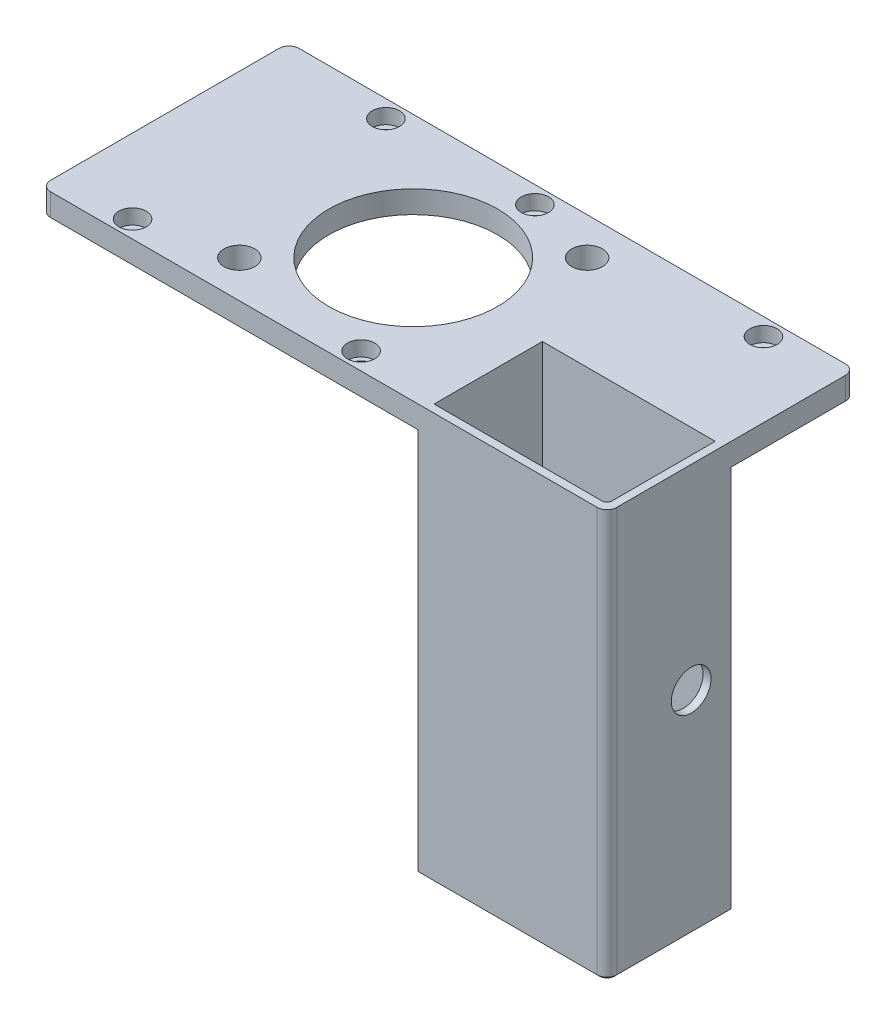
ISO-10303-21;
HEADER;
FILE_DESCRIPTION(('STEP AP214'),'2;1');
FILE_NAME('part.step','',(''),(''),'','','');
FILE_SCHEMA(('AUTOMOTIVE_DESIGN { 1 0 10303 214 1 1 1 1 }'));
ENDSEC;
DATA;
#1=APPLICATION_CONTEXT('core data for automotive mechanical design processes');
#2=APPLICATION_PROTOCOL_DEFINITION('international standard','automotive_design',2000,#1);
#3=PRODUCT_CONTEXT('',#1,'mechanical');
#4=PRODUCT('Part','Part','',(#3));
#5=PRODUCT_RELATED_PRODUCT_CATEGORY('part','',(#4));
#6=PRODUCT_DEFINITION_FORMATION('','',#4);
#7=PRODUCT_DEFINITION_CONTEXT('part definition',#1,'design');
#8=PRODUCT_DEFINITION('design','',#6,#7);
#9=PRODUCT_DEFINITION_SHAPE('','',#8);
#10=(LENGTH_UNIT() NAMED_UNIT(*) SI_UNIT(.MILLI.,.METRE.));
#11=(NAMED_UNIT(*) PLANE_ANGLE_UNIT() SI_UNIT($,.RADIAN.));
#12=(NAMED_UNIT(*) SI_UNIT($,.STERADIAN.) SOLID_ANGLE_UNIT());
#13=UNCERTAINTY_MEASURE_WITH_UNIT(LENGTH_MEASURE(1.E-05),#10,'distance_accuracy_value','');
#14=(GEOMETRIC_REPRESENTATION_CONTEXT(3) GLOBAL_UNCERTAINTY_ASSIGNED_CONTEXT((#13)) GLOBAL_UNIT_ASSIGNED_CONTEXT((#10,
#11,#12)) REPRESENTATION_CONTEXT('',''));
#15=CARTESIAN_POINT('',(0.,0.,0.));
#16=DIRECTION('',(0.,0.,1.));
#17=DIRECTION('',(1.,0.,0.));
#18=AXIS2_PLACEMENT_3D('',#15,#16,#17);
#19=CARTESIAN_POINT('',(-15.,4.5,-21.5));
#20=DIRECTION('',(0.,-1.,0.));
#21=DIRECTION('',(0.,0.,-1.));
#22=AXIS2_PLACEMENT_3D('',#19,#20,#21);
#23=CYLINDRICAL_SURFACE('',#22,1.6);
#24=CARTESIAN_POINT('',(-15.,0.,-21.5));
#25=DIRECTION('',(0.,1.,0.));
#26=DIRECTION('',(0.,0.,1.));
#27=AXIS2_PLACEMENT_3D('',#24,#25,#26);
#28=CIRCLE('',#27,1.6);
#29=CARTESIAN_POINT('',(-15.,0.,-19.9));
#30=VERTEX_POINT('',#29);
#31=EDGE_CURVE('E304',#30,#30,#28,.T.);
#32=ORIENTED_EDGE('',*,*,#31,.F.);
#33=EDGE_LOOP('',(#32));
#34=FACE_BOUND('',#33,.T.);
#35=CARTESIAN_POINT('',(-15.,1.5,-21.5));
#36=DIRECTION('',(0.,1.,0.));
#37=DIRECTION('',(0.,0.,1.));
#38=AXIS2_PLACEMENT_3D('',#35,#36,#37);
#39=CIRCLE('',#38,1.6);
#40=CARTESIAN_POINT('',(-15.,1.5,-19.9));
#41=VERTEX_POINT('',#40);
#42=EDGE_CURVE('E280',#41,#41,#39,.T.);
#43=ORIENTED_EDGE('',*,*,#42,.T.);
#44=EDGE_LOOP('',(#43));
#45=FACE_BOUND('',#44,.T.);
#46=ADVANCED_FACE('F41',(#34,#45),#23,.F.);
#47=CARTESIAN_POINT('',(15.,4.5,-21.5));
#48=DIRECTION('',(0.,-1.,0.));
#49=DIRECTION('',(0.,0.,-1.));
#50=AXIS2_PLACEMENT_3D('',#47,#48,#49);
#51=CYLINDRICAL_SURFACE('',#50,1.6);
#52=CARTESIAN_POINT('',(15.,0.,-21.5));
#53=DIRECTION('',(0.,1.,0.));
#54=DIRECTION('',(0.,0.,1.));
#55=AXIS2_PLACEMENT_3D('',#52,#53,#54);
#56=CIRCLE('',#55,1.6);
#57=CARTESIAN_POINT('',(15.,0.,-19.9));
#58=VERTEX_POINT('',#57);
#59=EDGE_CURVE('E301',#58,#58,#56,.T.);
#60=ORIENTED_EDGE('',*,*,#59,.F.);
#61=EDGE_LOOP('',(#60));
#62=FACE_BOUND('',#61,.T.);
#63=CARTESIAN_POINT('',(15.,1.5,-21.5));
#64=DIRECTION('',(0.,1.,0.));
#65=DIRECTION('',(0.,0.,1.));
#66=AXIS2_PLACEMENT_3D('',#63,#64,#65);
#67=CIRCLE('',#66,1.6);
#68=CARTESIAN_POINT('',(15.,1.5,-19.9));
#69=VERTEX_POINT('',#68);
#70=EDGE_CURVE('E349',#69,#69,#67,.T.);
#71=ORIENTED_EDGE('',*,*,#70,.T.);
#72=EDGE_LOOP('',(#71));
#73=FACE_BOUND('',#72,.T.);
#74=ADVANCED_FACE('F499',(#62,#73),#51,.F.);
#75=CARTESIAN_POINT('',(-23.,4.5,21.5));
#76=DIRECTION('',(0.,-1.,0.));
#77=DIRECTION('',(0.,0.,-1.));
#78=AXIS2_PLACEMENT_3D('',#75,#76,#77);
#79=CYLINDRICAL_SURFACE('',#78,1.52898904444072);
#80=CARTESIAN_POINT('',(-23.,0.,21.5));
#81=DIRECTION('',(0.,1.,0.));
#82=DIRECTION('',(0.,0.,1.));
#83=AXIS2_PLACEMENT_3D('',#80,#81,#82);
#84=CIRCLE('',#83,1.52898904444072);
#85=CARTESIAN_POINT('',(-23.,0.,23.0289890444407));
#86=VERTEX_POINT('',#85);
#87=EDGE_CURVE('E298',#86,#86,#84,.T.);
#88=ORIENTED_EDGE('',*,*,#87,.F.);
#89=EDGE_LOOP('',(#88));
#90=FACE_BOUND('',#89,.T.);
#91=CARTESIAN_POINT('',(-23.,1.5,21.5));
#92=DIRECTION('',(0.,1.,0.));
#93=DIRECTION('',(0.,0.,1.));
#94=AXIS2_PLACEMENT_3D('',#91,#92,#93);
#95=CIRCLE('',#94,1.52898904444072);
#96=CARTESIAN_POINT('',(-23.,1.5,23.0289890444407));
#97=VERTEX_POINT('',#96);
#98=EDGE_CURVE('E346',#97,#97,#95,.T.);
#99=ORIENTED_EDGE('',*,*,#98,.T.);
#100=EDGE_LOOP('',(#99));
#101=FACE_BOUND('',#100,.T.);
#102=ADVANCED_FACE('F505',(#90,#101),#79,.F.);
#103=CARTESIAN_POINT('',(23.,4.5,21.5));
#104=DIRECTION('',(0.,-1.,0.));
#105=DIRECTION('',(0.,0.,-1.));
#106=AXIS2_PLACEMENT_3D('',#103,#104,#105);
#107=CYLINDRICAL_SURFACE('',#106,1.81485839897255);
#108=CARTESIAN_POINT('',(23.,0.,21.5));
#109=DIRECTION('',(0.,1.,0.));
#110=DIRECTION('',(0.,0.,1.));
#111=AXIS2_PLACEMENT_3D('',#108,#109,#110);
#112=CIRCLE('',#111,1.81485839897255);
#113=CARTESIAN_POINT('',(23.,0.,23.3148583989725));
#114=VERTEX_POINT('',#113);
#115=EDGE_CURVE('E295',#114,#114,#112,.T.);
#116=ORIENTED_EDGE('',*,*,#115,.F.);
#117=EDGE_LOOP('',(#116));
#118=FACE_BOUND('',#117,.T.);
#119=CARTESIAN_POINT('',(23.,1.5,21.5));
#120=DIRECTION('',(0.,1.,0.));
#121=DIRECTION('',(0.,0.,1.));
#122=AXIS2_PLACEMENT_3D('',#119,#120,#121);
#123=CIRCLE('',#122,1.81485839897255);
#124=CARTESIAN_POINT('',(23.,1.5,23.3148583989725));
#125=VERTEX_POINT('',#124);
#126=EDGE_CURVE('E343',#125,#125,#123,.T.);
#127=ORIENTED_EDGE('',*,*,#126,.T.);
#128=EDGE_LOOP('',(#127));
#129=FACE_BOUND('',#128,.T.);
#130=ADVANCED_FACE('F815',(#118,#129),#107,.F.);
#131=CARTESIAN_POINT('',(61.,4.5,-21.5));
#132=DIRECTION('',(0.,-1.,0.));
#133=DIRECTION('',(0.,0.,-1.));
#134=AXIS2_PLACEMENT_3D('',#131,#132,#133);
#135=CYLINDRICAL_SURFACE('',#134,1.6);
#136=CARTESIAN_POINT('',(61.,0.,-21.5));
#137=DIRECTION('',(0.,1.,0.));
#138=DIRECTION('',(0.,0.,1.));
#139=AXIS2_PLACEMENT_3D('',#136,#137,#138);
#140=CIRCLE('',#139,1.6);
#141=CARTESIAN_POINT('',(61.,0.,-19.9));
#142=VERTEX_POINT('',#141);
#143=EDGE_CURVE('E290',#142,#142,#140,.T.);
#144=ORIENTED_EDGE('',*,*,#143,.F.);
#145=EDGE_LOOP('',(#144));
#146=FACE_BOUND('',#145,.T.);
#147=CARTESIAN_POINT('',(61.,1.5,-21.5));
#148=DIRECTION('',(0.,1.,0.));
#149=DIRECTION('',(0.,0.,1.));
#150=AXIS2_PLACEMENT_3D('',#147,#148,#149);
#151=CIRCLE('',#150,1.6);
#152=CARTESIAN_POINT('',(61.,1.5,-19.9));
#153=VERTEX_POINT('',#152);
#154=EDGE_CURVE('E269',#153,#153,#151,.T.);
#155=ORIENTED_EDGE('',*,*,#154,.T.);
#156=EDGE_LOOP('',(#155));
#157=FACE_BOUND('',#156,.T.);
#158=ADVANCED_FACE('F514',(#146,#157),#135,.F.);
#159=CARTESIAN_POINT('',(0.,4.5,0.));
#160=DIRECTION('',(0.,-1.,0.));
#161=DIRECTION('',(0.,0.,-1.));
#162=AXIS2_PLACEMENT_3D('',#159,#160,#161);
#163=PLANE('',#162);
#164=CARTESIAN_POINT('',(-23.,4.5,21.5));
#165=DIRECTION('',(0.,1.,0.));
#166=DIRECTION('',(0.,0.,1.));
#167=AXIS2_PLACEMENT_3D('',#164,#165,#166);
#168=CIRCLE('',#167,2.75);
#169=CARTESIAN_POINT('',(-23.,4.5,24.25));
#170=VERTEX_POINT('',#169);
#171=EDGE_CURVE('E236',#170,#170,#168,.T.);
#172=ORIENTED_EDGE('',*,*,#171,.F.);
#173=EDGE_LOOP('',(#172));
#174=FACE_BOUND('',#173,.T.);
#175=CARTESIAN_POINT('',(23.,4.5,21.5));
#176=DIRECTION('',(0.,1.,0.));
#177=DIRECTION('',(0.,0.,1.));
#178=AXIS2_PLACEMENT_3D('',#175,#176,#177);
#179=CIRCLE('',#178,2.75);
#180=CARTESIAN_POINT('',(23.,4.5,24.25));
#181=VERTEX_POINT('',#180);
#182=EDGE_CURVE('E258',#181,#181,#179,.T.);
#183=ORIENTED_EDGE('',*,*,#182,.F.);
#184=EDGE_LOOP('',(#183));
#185=FACE_BOUND('',#184,.T.);
#186=CARTESIAN_POINT('',(61.,4.5,-21.5));
#187=DIRECTION('',(0.,1.,0.));
#188=DIRECTION('',(0.,0.,1.));
#189=AXIS2_PLACEMENT_3D('',#186,#187,#188);
#190=CIRCLE('',#189,2.75000000000001);
#191=CARTESIAN_POINT('',(61.,4.5,-18.75));
#192=VERTEX_POINT('',#191);
#193=EDGE_CURVE('E252',#192,#192,#190,.T.);
#194=ORIENTED_EDGE('',*,*,#193,.F.);
#195=EDGE_LOOP('',(#194));
#196=FACE_BOUND('',#195,.T.);
#197=CARTESIAN_POINT('',(15.,4.5,-21.5));
#198=DIRECTION('',(0.,1.,0.));
#199=DIRECTION('',(0.,0.,1.));
#200=AXIS2_PLACEMENT_3D('',#197,#198,#199);
#201=CIRCLE('',#200,2.75);
#202=CARTESIAN_POINT('',(15.,4.5,-18.75));
#203=VERTEX_POINT('',#202);
#204=EDGE_CURVE('E246',#203,#203,#201,.T.);
#205=ORIENTED_EDGE('',*,*,#204,.F.);
#206=EDGE_LOOP('',(#205));
#207=FACE_BOUND('',#206,.T.);
#208=CARTESIAN_POINT('',(-15.,4.5,-21.5));
#209=DIRECTION('',(0.,1.,0.));
#210=DIRECTION('',(0.,0.,1.));
#211=AXIS2_PLACEMENT_3D('',#208,#209,#210);
#212=CIRCLE('',#211,2.75);
#213=CARTESIAN_POINT('',(-15.,4.5,-18.75));
#214=VERTEX_POINT('',#213);
#215=EDGE_CURVE('E245',#214,#214,#212,.T.);
#216=ORIENTED_EDGE('',*,*,#215,.F.);
#217=EDGE_LOOP('',(#216));
#218=FACE_BOUND('',#217,.T.);
#219=CARTESIAN_POINT('',(-5.50000000000001,4.5,17.5));
#220=DIRECTION('',(0.,1.,0.));
#221=DIRECTION('',(0.,0.,1.));
#222=AXIS2_PLACEMENT_3D('',#219,#220,#221);
#223=CIRCLE('',#222,3.1);
#224=CARTESIAN_POINT('',(-5.50000000000001,4.5,20.6));
#225=VERTEX_POINT('',#224);
#226=EDGE_CURVE('E275',#225,#225,#223,.T.);
#227=ORIENTED_EDGE('',*,*,#226,.F.);
#228=EDGE_LOOP('',(#227));
#229=FACE_BOUND('',#228,.T.);
#230=CARTESIAN_POINT('',(12.,4.5,0.));
#231=DIRECTION('',(0.,1.,0.));
#232=DIRECTION('',(0.,0.,1.));
#233=AXIS2_PLACEMENT_3D('',#230,#231,#232);
#234=CIRCLE('',#233,17.);
#235=CARTESIAN_POINT('',(12.,4.5,17.));
#236=VERTEX_POINT('',#235);
#237=EDGE_CURVE('E276',#236,#236,#234,.T.);
#238=ORIENTED_EDGE('',*,*,#237,.F.);
#239=EDGE_LOOP('',(#238));
#240=FACE_BOUND('',#239,.T.);
#241=CARTESIAN_POINT('',(29.5,4.5,-17.5));
#242=DIRECTION('',(0.,1.,0.));
#243=DIRECTION('',(0.,0.,1.));
#244=AXIS2_PLACEMENT_3D('',#241,#242,#243);
#245=CIRCLE('',#244,3.09999999999999);
#246=CARTESIAN_POINT('',(29.5,4.5,-14.4));
#247=VERTEX_POINT('',#246);
#248=EDGE_CURVE('E284',#247,#247,#245,.T.);
#249=ORIENTED_EDGE('',*,*,#248,.F.);
#250=EDGE_LOOP('',(#249));
#251=FACE_BOUND('',#250,.T.);
#252=DIRECTION('',(0.,0.,-1.));
#253=VECTOR('',#252,1.);
#254=CARTESIAN_POINT('',(76.,4.5,-25.));
#255=LINE('',#254,#253);
#256=CARTESIAN_POINT('',(76.,4.5,23.));
#257=VERTEX_POINT('',#256);
#258=CARTESIAN_POINT('',(76.,4.5,-23.));
#259=VERTEX_POINT('',#258);
#260=EDGE_CURVE('E308',#257,#259,#255,.T.);
#261=ORIENTED_EDGE('',*,*,#260,.T.);
#262=CARTESIAN_POINT('',(74.,4.5,-23.));
#263=DIRECTION('',(0.,-1.,0.));
#264=DIRECTION('',(0.,0.,-1.));
#265=AXIS2_PLACEMENT_3D('',#262,#263,#264);
#266=CIRCLE('',#265,2.);
#267=CARTESIAN_POINT('',(74.,4.5,-25.));
#268=VERTEX_POINT('',#267);
#269=EDGE_CURVE('E375',#259,#268,#266,.F.);
#270=ORIENTED_EDGE('',*,*,#269,.T.);
#271=DIRECTION('',(-1.,0.,0.));
#272=VECTOR('',#271,1.);
#273=CARTESIAN_POINT('',(-38.,4.5,-25.));
#274=LINE('',#273,#272);
#275=CARTESIAN_POINT('',(-36.,4.5,-25.));
#276=VERTEX_POINT('',#275);
#277=EDGE_CURVE('E311',#268,#276,#274,.T.);
#278=ORIENTED_EDGE('',*,*,#277,.T.);
#279=CARTESIAN_POINT('',(-36.,4.5,-23.));
#280=DIRECTION('',(0.,-1.,0.));
#281=DIRECTION('',(0.,0.,-1.));
#282=AXIS2_PLACEMENT_3D('',#279,#280,#281);
#283=CIRCLE('',#282,2.);
#284=CARTESIAN_POINT('',(-38.,4.5,-23.));
#285=VERTEX_POINT('',#284);
#286=EDGE_CURVE('E369',#276,#285,#283,.F.);
#287=ORIENTED_EDGE('',*,*,#286,.T.);
#288=DIRECTION('',(0.,0.,1.));
#289=VECTOR('',#288,1.);
#290=CARTESIAN_POINT('',(-38.,4.5,0.));
#291=LINE('',#290,#289);
#292=CARTESIAN_POINT('',(-38.,4.5,23.));
#293=VERTEX_POINT('',#292);
#294=EDGE_CURVE('E315',#285,#293,#291,.T.);
#295=ORIENTED_EDGE('',*,*,#294,.T.);
#296=CARTESIAN_POINT('',(-36.,4.5,23.));
#297=DIRECTION('',(0.,-1.,0.));
#298=DIRECTION('',(0.,0.,-1.));
#299=AXIS2_PLACEMENT_3D('',#296,#297,#298);
#300=CIRCLE('',#299,2.);
#301=CARTESIAN_POINT('',(-36.,4.5,25.));
#302=VERTEX_POINT('',#301);
#303=EDGE_CURVE('E371',#293,#302,#300,.F.);
#304=ORIENTED_EDGE('',*,*,#303,.T.);
#305=DIRECTION('',(1.,0.,0.));
#306=VECTOR('',#305,1.);
#307=CARTESIAN_POINT('',(38.,4.5,25.));
#308=LINE('',#307,#306);
#309=CARTESIAN_POINT('',(74.,4.5,25.));
#310=VERTEX_POINT('',#309);
#311=EDGE_CURVE('E318',#302,#310,#308,.T.);
#312=ORIENTED_EDGE('',*,*,#311,.T.);
#313=CARTESIAN_POINT('',(74.,4.5,23.));
#314=DIRECTION('',(0.,-1.,0.));
#315=DIRECTION('',(0.,0.,-1.));
#316=AXIS2_PLACEMENT_3D('',#313,#314,#315);
#317=CIRCLE('',#316,2.);
#318=EDGE_CURVE('E373',#310,#257,#317,.F.);
#319=ORIENTED_EDGE('',*,*,#318,.T.);
#320=EDGE_LOOP('',(#261,#270,#278,#287,#295,#304,#312,#319));
#321=FACE_BOUND('',#320,.T.);
#322=DIRECTION('',(-1.,0.,0.));
#323=VECTOR('',#322,1.);
#324=CARTESIAN_POINT('',(74.4,4.5,1.6));
#325=LINE('',#324,#323);
#326=CARTESIAN_POINT('',(74.4,4.5,1.6));
#327=VERTEX_POINT('',#326);
#328=CARTESIAN_POINT('',(39.6,4.5,1.6));
#329=VERTEX_POINT('',#328);
#330=EDGE_CURVE('E211',#327,#329,#325,.T.);
#331=ORIENTED_EDGE('',*,*,#330,.F.);
#332=DIRECTION('',(0.,0.,-1.));
#333=VECTOR('',#332,1.);
#334=CARTESIAN_POINT('',(74.4,4.5,1.6));
#335=LINE('',#334,#333);
#336=CARTESIAN_POINT('',(74.4,4.5,22.4));
#337=VERTEX_POINT('',#336);
#338=EDGE_CURVE('E191',#337,#327,#335,.T.);
#339=ORIENTED_EDGE('',*,*,#338,.F.);
#340=CARTESIAN_POINT('',(73.4,4.5,22.4));
#341=DIRECTION('',(0.,-1.,0.));
#342=DIRECTION('',(0.,0.,-1.));
#343=AXIS2_PLACEMENT_3D('',#340,#341,#342);
#344=CIRCLE('',#343,1.);
#345=CARTESIAN_POINT('',(73.4,4.5,23.4));
#346=VERTEX_POINT('',#345);
#347=EDGE_CURVE('E391',#337,#346,#344,.T.);
#348=ORIENTED_EDGE('',*,*,#347,.T.);
#349=DIRECTION('',(1.,0.,0.));
#350=VECTOR('',#349,1.);
#351=CARTESIAN_POINT('',(74.4,4.5,23.4));
#352=LINE('',#351,#350);
#353=CARTESIAN_POINT('',(39.6,4.5,23.4));
#354=VERTEX_POINT('',#353);
#355=EDGE_CURVE('E185',#354,#346,#352,.T.);
#356=ORIENTED_EDGE('',*,*,#355,.F.);
#357=DIRECTION('',(0.,0.,1.));
#358=VECTOR('',#357,1.);
#359=CARTESIAN_POINT('',(39.6,4.5,23.4));
#360=LINE('',#359,#358);
#361=EDGE_CURVE('E215',#329,#354,#360,.T.);
#362=ORIENTED_EDGE('',*,*,#361,.F.);
#363=EDGE_LOOP('',(#331,#339,#348,#356,#362));
#364=FACE_BOUND('',#363,.T.);
#365=ADVANCED_FACE('F462',(#174,#185,#196,#207,#218,#229,#240,#251,#321,#364),#163,.F.);
#366=CARTESIAN_POINT('',(0.,0.,0.));
#367=DIRECTION('',(0.,-1.,0.));
#368=DIRECTION('',(0.,0.,-1.));
#369=AXIS2_PLACEMENT_3D('',#366,#367,#368);
#370=PLANE('',#369);
#371=CARTESIAN_POINT('',(-5.50000000000001,0.,17.5));
#372=DIRECTION('',(0.,1.,0.));
#373=DIRECTION('',(0.,0.,1.));
#374=AXIS2_PLACEMENT_3D('',#371,#372,#373);
#375=CIRCLE('',#374,3.1);
#376=CARTESIAN_POINT('',(-5.50000000000001,0.,20.6));
#377=VERTEX_POINT('',#376);
#378=EDGE_CURVE('E281',#377,#377,#375,.T.);
#379=ORIENTED_EDGE('',*,*,#378,.T.);
#380=EDGE_LOOP('',(#379));
#381=FACE_BOUND('',#380,.T.);
#382=CARTESIAN_POINT('',(12.,0.,0.));
#383=DIRECTION('',(0.,1.,0.));
#384=DIRECTION('',(0.,0.,1.));
#385=AXIS2_PLACEMENT_3D('',#382,#383,#384);
#386=CIRCLE('',#385,17.);
#387=CARTESIAN_POINT('',(12.,0.,17.));
#388=VERTEX_POINT('',#387);
#389=EDGE_CURVE('E272',#388,#388,#386,.T.);
#390=ORIENTED_EDGE('',*,*,#389,.T.);
#391=EDGE_LOOP('',(#390));
#392=FACE_BOUND('',#391,.T.);
#393=CARTESIAN_POINT('',(29.5,0.,-17.5));
#394=DIRECTION('',(0.,1.,0.));
#395=DIRECTION('',(0.,0.,1.));
#396=AXIS2_PLACEMENT_3D('',#393,#394,#395);
#397=CIRCLE('',#396,3.09999999999999);
#398=CARTESIAN_POINT('',(29.5,0.,-14.4));
#399=VERTEX_POINT('',#398);
#400=EDGE_CURVE('E287',#399,#399,#397,.T.);
#401=ORIENTED_EDGE('',*,*,#400,.T.);
#402=EDGE_LOOP('',(#401));
#403=FACE_BOUND('',#402,.T.);
#404=ORIENTED_EDGE('',*,*,#115,.T.);
#405=EDGE_LOOP('',(#404));
#406=FACE_BOUND('',#405,.T.);
#407=ORIENTED_EDGE('',*,*,#59,.T.);
#408=EDGE_LOOP('',(#407));
#409=FACE_BOUND('',#408,.T.);
#410=DIRECTION('',(-1.,0.,0.));
#411=VECTOR('',#410,1.);
#412=CARTESIAN_POINT('',(-38.,0.,-25.));
#413=LINE('',#412,#411);
#414=CARTESIAN_POINT('',(74.,0.,-25.));
#415=VERTEX_POINT('',#414);
#416=CARTESIAN_POINT('',(-36.,0.,-25.));
#417=VERTEX_POINT('',#416);
#418=EDGE_CURVE('E332',#415,#417,#413,.T.);
#419=ORIENTED_EDGE('',*,*,#418,.F.);
#420=CARTESIAN_POINT('',(74.,0.,-23.));
#421=DIRECTION('',(0.,-1.,0.));
#422=DIRECTION('',(0.,0.,-1.));
#423=AXIS2_PLACEMENT_3D('',#420,#421,#422);
#424=CIRCLE('',#423,2.);
#425=CARTESIAN_POINT('',(76.,0.,-23.));
#426=VERTEX_POINT('',#425);
#427=EDGE_CURVE('E362',#415,#426,#424,.T.);
#428=ORIENTED_EDGE('',*,*,#427,.T.);
#429=DIRECTION('',(0.,0.,-1.));
#430=VECTOR('',#429,1.);
#431=CARTESIAN_POINT('',(76.,0.,-25.));
#432=LINE('',#431,#430);
#433=CARTESIAN_POINT('',(76.,0.,0.));
#434=VERTEX_POINT('',#433);
#435=EDGE_CURVE('E329',#434,#426,#432,.T.);
#436=ORIENTED_EDGE('',*,*,#435,.F.);
#437=DIRECTION('',(1.,0.,0.));
#438=VECTOR('',#437,1.);
#439=CARTESIAN_POINT('',(76.,0.,0.));
#440=LINE('',#439,#438);
#441=CARTESIAN_POINT('',(38.,0.,0.));
#442=VERTEX_POINT('',#441);
#443=EDGE_CURVE('E325',#442,#434,#440,.T.);
#444=ORIENTED_EDGE('',*,*,#443,.F.);
#445=DIRECTION('',(0.,0.,-1.));
#446=VECTOR('',#445,1.);
#447=CARTESIAN_POINT('',(38.,0.,0.));
#448=LINE('',#447,#446);
#449=CARTESIAN_POINT('',(38.,0.,25.));
#450=VERTEX_POINT('',#449);
#451=EDGE_CURVE('E307',#450,#442,#448,.T.);
#452=ORIENTED_EDGE('',*,*,#451,.F.);
#453=DIRECTION('',(1.,0.,0.));
#454=VECTOR('',#453,1.);
#455=CARTESIAN_POINT('',(38.,0.,25.));
#456=LINE('',#455,#454);
#457=CARTESIAN_POINT('',(-36.,0.,25.));
#458=VERTEX_POINT('',#457);
#459=EDGE_CURVE('E312',#458,#450,#456,.T.);
#460=ORIENTED_EDGE('',*,*,#459,.F.);
#461=CARTESIAN_POINT('',(-36.,0.,23.));
#462=DIRECTION('',(0.,-1.,0.));
#463=DIRECTION('',(0.,0.,-1.));
#464=AXIS2_PLACEMENT_3D('',#461,#462,#463);
#465=CIRCLE('',#464,2.);
#466=CARTESIAN_POINT('',(-38.,0.,23.));
#467=VERTEX_POINT('',#466);
#468=EDGE_CURVE('E360',#458,#467,#465,.T.);
#469=ORIENTED_EDGE('',*,*,#468,.T.);
#470=DIRECTION('',(0.,0.,1.));
#471=VECTOR('',#470,1.);
#472=CARTESIAN_POINT('',(-38.,0.,25.));
#473=LINE('',#472,#471);
#474=CARTESIAN_POINT('',(-38.,0.,-23.));
#475=VERTEX_POINT('',#474);
#476=EDGE_CURVE('E335',#475,#467,#473,.T.);
#477=ORIENTED_EDGE('',*,*,#476,.F.);
#478=CARTESIAN_POINT('',(-36.,0.,-23.));
#479=DIRECTION('',(0.,-1.,0.));
#480=DIRECTION('',(0.,0.,-1.));
#481=AXIS2_PLACEMENT_3D('',#478,#479,#480);
#482=CIRCLE('',#481,2.);
#483=EDGE_CURVE('E358',#475,#417,#482,.T.);
#484=ORIENTED_EDGE('',*,*,#483,.T.);
#485=EDGE_LOOP('',(#419,#428,#436,#444,#452,#460,#469,#477,#484));
#486=FACE_BOUND('',#485,.T.);
#487=ORIENTED_EDGE('',*,*,#31,.T.);
#488=EDGE_LOOP('',(#487));
#489=FACE_BOUND('',#488,.T.);
#490=ORIENTED_EDGE('',*,*,#87,.T.);
#491=EDGE_LOOP('',(#490));
#492=FACE_BOUND('',#491,.T.);
#493=ORIENTED_EDGE('',*,*,#143,.T.);
#494=EDGE_LOOP('',(#493));
#495=FACE_BOUND('',#494,.T.);
#496=ADVANCED_FACE('F449',(#381,#392,#403,#406,#409,#486,#489,#492,#495),#370,.T.);
#497=CARTESIAN_POINT('',(76.,4.5,-25.));
#498=DIRECTION('',(-1.,0.,0.));
#499=DIRECTION('',(0.,0.,1.));
#500=AXIS2_PLACEMENT_3D('',#497,#498,#499);
#501=PLANE('',#500);
#502=CARTESIAN_POINT('',(76.,-34.8459753806032,8.04958648106249));
#503=DIRECTION('',(1.,0.,0.));
#504=DIRECTION('',(0.,0.,-1.));
#505=AXIS2_PLACEMENT_3D('',#502,#503,#504);
#506=CIRCLE('',#505,4.);
#507=CARTESIAN_POINT('',(76.,-34.8459753806032,4.04958648106249));
#508=VERTEX_POINT('',#507);
#509=EDGE_CURVE('E414',#508,#508,#506,.T.);
#510=ORIENTED_EDGE('',*,*,#509,.F.);
#511=EDGE_LOOP('',(#510));
#512=FACE_BOUND('',#511,.T.);
#513=DIRECTION('',(0.,1.,0.));
#514=VECTOR('',#513,1.);
#515=CARTESIAN_POINT('',(76.,4.5,23.));
#516=LINE('',#515,#514);
#517=CARTESIAN_POINT('',(76.,-77.,23.));
#518=VERTEX_POINT('',#517);
#519=EDGE_CURVE('E364',#257,#518,#516,.F.);
#520=ORIENTED_EDGE('',*,*,#519,.T.);
#521=DIRECTION('',(0.,0.,-1.));
#522=VECTOR('',#521,1.);
#523=CARTESIAN_POINT('',(76.,-77.,0.));
#524=LINE('',#523,#522);
#525=CARTESIAN_POINT('',(76.,-77.,0.));
#526=VERTEX_POINT('',#525);
#527=EDGE_CURVE('E394',#518,#526,#524,.T.);
#528=ORIENTED_EDGE('',*,*,#527,.T.);
#529=DIRECTION('',(0.,1.,0.));
#530=VECTOR('',#529,1.);
#531=CARTESIAN_POINT('',(76.,-77.5,0.));
#532=LINE('',#531,#530);
#533=EDGE_CURVE('E232',#526,#434,#532,.T.);
#534=ORIENTED_EDGE('',*,*,#533,.T.);
#535=ORIENTED_EDGE('',*,*,#435,.T.);
#536=DIRECTION('',(0.,-1.,0.));
#537=VECTOR('',#536,1.);
#538=CARTESIAN_POINT('',(76.,4.5,-23.));
#539=LINE('',#538,#537);
#540=EDGE_CURVE('E367',#426,#259,#539,.F.);
#541=ORIENTED_EDGE('',*,*,#540,.T.);
#542=ORIENTED_EDGE('',*,*,#260,.F.);
#543=EDGE_LOOP('',(#520,#528,#534,#535,#541,#542));
#544=FACE_BOUND('',#543,.T.);
#545=ADVANCED_FACE('F445',(#512,#544),#501,.F.);
#546=CARTESIAN_POINT('',(-38.,4.5,-25.));
#547=DIRECTION('',(0.,0.,1.));
#548=DIRECTION('',(1.,0.,0.));
#549=AXIS2_PLACEMENT_3D('',#546,#547,#548);
#550=PLANE('',#549);
#551=ORIENTED_EDGE('',*,*,#277,.F.);
#552=DIRECTION('',(0.,-1.,0.));
#553=VECTOR('',#552,1.);
#554=CARTESIAN_POINT('',(74.,4.5,-25.));
#555=LINE('',#554,#553);
#556=EDGE_CURVE('E355',#268,#415,#555,.T.);
#557=ORIENTED_EDGE('',*,*,#556,.T.);
#558=ORIENTED_EDGE('',*,*,#418,.T.);
#559=DIRECTION('',(0.,-1.,0.));
#560=VECTOR('',#559,1.);
#561=CARTESIAN_POINT('',(-36.,4.5,-25.));
#562=LINE('',#561,#560);
#563=EDGE_CURVE('E321',#417,#276,#562,.F.);
#564=ORIENTED_EDGE('',*,*,#563,.T.);
#565=EDGE_LOOP('',(#551,#557,#558,#564));
#566=FACE_BOUND('',#565,.T.);
#567=ADVANCED_FACE('F458',(#566),#550,.F.);
#568=CARTESIAN_POINT('',(-38.,4.5,25.));
#569=DIRECTION('',(1.,0.,0.));
#570=DIRECTION('',(0.,0.,-1.));
#571=AXIS2_PLACEMENT_3D('',#568,#569,#570);
#572=PLANE('',#571);
#573=ORIENTED_EDGE('',*,*,#476,.T.);
#574=DIRECTION('',(0.,-1.,0.));
#575=VECTOR('',#574,1.);
#576=CARTESIAN_POINT('',(-38.,4.5,23.));
#577=LINE('',#576,#575);
#578=EDGE_CURVE('E385',#467,#293,#577,.F.);
#579=ORIENTED_EDGE('',*,*,#578,.T.);
#580=ORIENTED_EDGE('',*,*,#294,.F.);
#581=DIRECTION('',(0.,-1.,0.));
#582=VECTOR('',#581,1.);
#583=CARTESIAN_POINT('',(-38.,4.5,-23.));
#584=LINE('',#583,#582);
#585=EDGE_CURVE('E382',#285,#475,#584,.T.);
#586=ORIENTED_EDGE('',*,*,#585,.T.);
#587=EDGE_LOOP('',(#573,#579,#580,#586));
#588=FACE_BOUND('',#587,.T.);
#589=ADVANCED_FACE('F470',(#588),#572,.F.);
#590=CARTESIAN_POINT('',(38.,4.5,25.));
#591=DIRECTION('',(0.,0.,-1.));
#592=DIRECTION('',(-1.,0.,0.));
#593=AXIS2_PLACEMENT_3D('',#590,#591,#592);
#594=PLANE('',#593);
#595=DIRECTION('',(0.,1.,0.));
#596=VECTOR('',#595,1.);
#597=CARTESIAN_POINT('',(38.,-77.5,25.));
#598=LINE('',#597,#596);
#599=CARTESIAN_POINT('',(38.,-77.,25.));
#600=VERTEX_POINT('',#599);
#601=EDGE_CURVE('E233',#600,#450,#598,.T.);
#602=ORIENTED_EDGE('',*,*,#601,.F.);
#603=DIRECTION('',(1.,0.,0.));
#604=VECTOR('',#603,1.);
#605=CARTESIAN_POINT('',(74.,-77.,25.));
#606=LINE('',#605,#604);
#607=CARTESIAN_POINT('',(74.,-77.,25.));
#608=VERTEX_POINT('',#607);
#609=EDGE_CURVE('E51',#600,#608,#606,.T.);
#610=ORIENTED_EDGE('',*,*,#609,.T.);
#611=DIRECTION('',(0.,1.,0.));
#612=VECTOR('',#611,1.);
#613=CARTESIAN_POINT('',(74.,4.5,25.));
#614=LINE('',#613,#612);
#615=EDGE_CURVE('E380',#608,#310,#614,.T.);
#616=ORIENTED_EDGE('',*,*,#615,.T.);
#617=ORIENTED_EDGE('',*,*,#311,.F.);
#618=DIRECTION('',(0.,-1.,0.));
#619=VECTOR('',#618,1.);
#620=CARTESIAN_POINT('',(-36.,4.5,25.));
#621=LINE('',#620,#619);
#622=EDGE_CURVE('E377',#302,#458,#621,.T.);
#623=ORIENTED_EDGE('',*,*,#622,.T.);
#624=ORIENTED_EDGE('',*,*,#459,.T.);
#625=EDGE_LOOP('',(#602,#610,#616,#617,#623,#624));
#626=FACE_BOUND('',#625,.T.);
#627=ADVANCED_FACE('F478',(#626),#594,.F.);
#628=CARTESIAN_POINT('',(29.5,0.,-17.5));
#629=DIRECTION('',(0.,1.,0.));
#630=DIRECTION('',(0.,0.,1.));
#631=AXIS2_PLACEMENT_3D('',#628,#629,#630);
#632=CYLINDRICAL_SURFACE('',#631,3.09999999999999);
#633=ORIENTED_EDGE('',*,*,#400,.F.);
#634=EDGE_LOOP('',(#633));
#635=FACE_BOUND('',#634,.T.);
#636=ORIENTED_EDGE('',*,*,#248,.T.);
#637=EDGE_LOOP('',(#636));
#638=FACE_BOUND('',#637,.T.);
#639=ADVANCED_FACE('F521',(#635,#638),#632,.F.);
#640=CARTESIAN_POINT('',(12.,0.,0.));
#641=DIRECTION('',(0.,1.,0.));
#642=DIRECTION('',(0.,0.,1.));
#643=AXIS2_PLACEMENT_3D('',#640,#641,#642);
#644=CYLINDRICAL_SURFACE('',#643,17.);
#645=ORIENTED_EDGE('',*,*,#389,.F.);
#646=EDGE_LOOP('',(#645));
#647=FACE_BOUND('',#646,.T.);
#648=ORIENTED_EDGE('',*,*,#237,.T.);
#649=EDGE_LOOP('',(#648));
#650=FACE_BOUND('',#649,.T.);
#651=ADVANCED_FACE('F850',(#647,#650),#644,.F.);
#652=CARTESIAN_POINT('',(-5.50000000000001,0.,17.5));
#653=DIRECTION('',(0.,1.,0.));
#654=DIRECTION('',(0.,0.,1.));
#655=AXIS2_PLACEMENT_3D('',#652,#653,#654);
#656=CYLINDRICAL_SURFACE('',#655,3.1);
#657=ORIENTED_EDGE('',*,*,#378,.F.);
#658=EDGE_LOOP('',(#657));
#659=FACE_BOUND('',#658,.T.);
#660=ORIENTED_EDGE('',*,*,#226,.T.);
#661=EDGE_LOOP('',(#660));
#662=FACE_BOUND('',#661,.T.);
#663=ADVANCED_FACE('F803',(#659,#662),#656,.F.);
#664=CARTESIAN_POINT('',(61.,1.5,-21.5));
#665=DIRECTION('',(0.,1.,0.));
#666=DIRECTION('',(0.,0.,1.));
#667=AXIS2_PLACEMENT_3D('',#664,#665,#666);
#668=CYLINDRICAL_SURFACE('',#667,2.75000000000001);
#669=CARTESIAN_POINT('',(61.,1.5,-21.5));
#670=DIRECTION('',(0.,1.,0.));
#671=DIRECTION('',(0.,0.,1.));
#672=AXIS2_PLACEMENT_3D('',#669,#670,#671);
#673=CIRCLE('',#672,2.75000000000001);
#674=CARTESIAN_POINT('',(61.,1.5,-18.75));
#675=VERTEX_POINT('',#674);
#676=EDGE_CURVE('E249',#675,#675,#673,.T.);
#677=ORIENTED_EDGE('',*,*,#676,.F.);
#678=EDGE_LOOP('',(#677));
#679=FACE_BOUND('',#678,.T.);
#680=ORIENTED_EDGE('',*,*,#193,.T.);
#681=EDGE_LOOP('',(#680));
#682=FACE_BOUND('',#681,.T.);
#683=ADVANCED_FACE('F793',(#679,#682),#668,.F.);
#684=CARTESIAN_POINT('',(61.,1.5,-21.5));
#685=DIRECTION('',(0.,1.,0.));
#686=DIRECTION('',(0.,0.,1.));
#687=AXIS2_PLACEMENT_3D('',#684,#685,#686);
#688=PLANE('',#687);
#689=ORIENTED_EDGE('',*,*,#154,.F.);
#690=EDGE_LOOP('',(#689));
#691=FACE_BOUND('',#690,.T.);
#692=ORIENTED_EDGE('',*,*,#676,.T.);
#693=EDGE_LOOP('',(#692));
#694=FACE_BOUND('',#693,.T.);
#695=ADVANCED_FACE('F783',(#691,#694),#688,.T.);
#696=CARTESIAN_POINT('',(23.,1.5,21.5));
#697=DIRECTION('',(0.,1.,0.));
#698=DIRECTION('',(0.,0.,1.));
#699=AXIS2_PLACEMENT_3D('',#696,#697,#698);
#700=CYLINDRICAL_SURFACE('',#699,2.75);
#701=CARTESIAN_POINT('',(23.,1.5,21.5));
#702=DIRECTION('',(0.,1.,0.));
#703=DIRECTION('',(0.,0.,1.));
#704=AXIS2_PLACEMENT_3D('',#701,#702,#703);
#705=CIRCLE('',#704,2.75);
#706=CARTESIAN_POINT('',(23.,1.5,24.25));
#707=VERTEX_POINT('',#706);
#708=EDGE_CURVE('E255',#707,#707,#705,.T.);
#709=ORIENTED_EDGE('',*,*,#708,.F.);
#710=EDGE_LOOP('',(#709));
#711=FACE_BOUND('',#710,.T.);
#712=ORIENTED_EDGE('',*,*,#182,.T.);
#713=EDGE_LOOP('',(#712));
#714=FACE_BOUND('',#713,.T.);
#715=ADVANCED_FACE('F773',(#711,#714),#700,.F.);
#716=CARTESIAN_POINT('',(23.,1.5,21.5));
#717=DIRECTION('',(0.,1.,0.));
#718=DIRECTION('',(0.,0.,1.));
#719=AXIS2_PLACEMENT_3D('',#716,#717,#718);
#720=PLANE('',#719);
#721=ORIENTED_EDGE('',*,*,#126,.F.);
#722=EDGE_LOOP('',(#721));
#723=FACE_BOUND('',#722,.T.);
#724=ORIENTED_EDGE('',*,*,#708,.T.);
#725=EDGE_LOOP('',(#724));
#726=FACE_BOUND('',#725,.T.);
#727=ADVANCED_FACE('F763',(#723,#726),#720,.T.);
#728=CARTESIAN_POINT('',(-23.,1.5,21.5));
#729=DIRECTION('',(0.,1.,0.));
#730=DIRECTION('',(0.,0.,1.));
#731=AXIS2_PLACEMENT_3D('',#728,#729,#730);
#732=CYLINDRICAL_SURFACE('',#731,2.75);
#733=CARTESIAN_POINT('',(-23.,1.5,21.5));
#734=DIRECTION('',(0.,1.,0.));
#735=DIRECTION('',(0.,0.,1.));
#736=AXIS2_PLACEMENT_3D('',#733,#734,#735);
#737=CIRCLE('',#736,2.75);
#738=CARTESIAN_POINT('',(-23.,1.5,24.25));
#739=VERTEX_POINT('',#738);
#740=EDGE_CURVE('E261',#739,#739,#737,.T.);
#741=ORIENTED_EDGE('',*,*,#740,.F.);
#742=EDGE_LOOP('',(#741));
#743=FACE_BOUND('',#742,.T.);
#744=ORIENTED_EDGE('',*,*,#171,.T.);
#745=EDGE_LOOP('',(#744));
#746=FACE_BOUND('',#745,.T.);
#747=ADVANCED_FACE('F753',(#743,#746),#732,.F.);
#748=CARTESIAN_POINT('',(-23.,1.5,21.5));
#749=DIRECTION('',(0.,1.,0.));
#750=DIRECTION('',(0.,0.,1.));
#751=AXIS2_PLACEMENT_3D('',#748,#749,#750);
#752=PLANE('',#751);
#753=ORIENTED_EDGE('',*,*,#98,.F.);
#754=EDGE_LOOP('',(#753));
#755=FACE_BOUND('',#754,.T.);
#756=ORIENTED_EDGE('',*,*,#740,.T.);
#757=EDGE_LOOP('',(#756));
#758=FACE_BOUND('',#757,.T.);
#759=ADVANCED_FACE('F743',(#755,#758),#752,.T.);
#760=CARTESIAN_POINT('',(15.,1.5,-21.5));
#761=DIRECTION('',(0.,1.,0.));
#762=DIRECTION('',(0.,0.,1.));
#763=AXIS2_PLACEMENT_3D('',#760,#761,#762);
#764=CYLINDRICAL_SURFACE('',#763,2.75);
#765=CARTESIAN_POINT('',(15.,1.5,-21.5));
#766=DIRECTION('',(0.,1.,0.));
#767=DIRECTION('',(0.,0.,1.));
#768=AXIS2_PLACEMENT_3D('',#765,#766,#767);
#769=CIRCLE('',#768,2.75);
#770=CARTESIAN_POINT('',(15.,1.5,-18.75));
#771=VERTEX_POINT('',#770);
#772=EDGE_CURVE('E242',#771,#771,#769,.T.);
#773=ORIENTED_EDGE('',*,*,#772,.F.);
#774=EDGE_LOOP('',(#773));
#775=FACE_BOUND('',#774,.T.);
#776=ORIENTED_EDGE('',*,*,#204,.T.);
#777=EDGE_LOOP('',(#776));
#778=FACE_BOUND('',#777,.T.);
#779=ADVANCED_FACE('F733',(#775,#778),#764,.F.);
#780=CARTESIAN_POINT('',(15.,1.5,-21.5));
#781=DIRECTION('',(0.,1.,0.));
#782=DIRECTION('',(0.,0.,1.));
#783=AXIS2_PLACEMENT_3D('',#780,#781,#782);
#784=PLANE('',#783);
#785=ORIENTED_EDGE('',*,*,#70,.F.);
#786=EDGE_LOOP('',(#785));
#787=FACE_BOUND('',#786,.T.);
#788=ORIENTED_EDGE('',*,*,#772,.T.);
#789=EDGE_LOOP('',(#788));
#790=FACE_BOUND('',#789,.T.);
#791=ADVANCED_FACE('F723',(#787,#790),#784,.T.);
#792=CARTESIAN_POINT('',(-15.,1.5,-21.5));
#793=DIRECTION('',(0.,1.,0.));
#794=DIRECTION('',(0.,0.,1.));
#795=AXIS2_PLACEMENT_3D('',#792,#793,#794);
#796=CYLINDRICAL_SURFACE('',#795,2.75);
#797=CARTESIAN_POINT('',(-15.,1.5,-21.5));
#798=DIRECTION('',(0.,1.,0.));
#799=DIRECTION('',(0.,0.,1.));
#800=AXIS2_PLACEMENT_3D('',#797,#798,#799);
#801=CIRCLE('',#800,2.75);
#802=CARTESIAN_POINT('',(-15.,1.5,-18.75));
#803=VERTEX_POINT('',#802);
#804=EDGE_CURVE('E266',#803,#803,#801,.T.);
#805=ORIENTED_EDGE('',*,*,#804,.F.);
#806=EDGE_LOOP('',(#805));
#807=FACE_BOUND('',#806,.T.);
#808=ORIENTED_EDGE('',*,*,#215,.T.);
#809=EDGE_LOOP('',(#808));
#810=FACE_BOUND('',#809,.T.);
#811=ADVANCED_FACE('F713',(#807,#810),#796,.F.);
#812=CARTESIAN_POINT('',(-15.,1.5,-21.5));
#813=DIRECTION('',(0.,1.,0.));
#814=DIRECTION('',(0.,0.,1.));
#815=AXIS2_PLACEMENT_3D('',#812,#813,#814);
#816=PLANE('',#815);
#817=ORIENTED_EDGE('',*,*,#42,.F.);
#818=EDGE_LOOP('',(#817));
#819=FACE_BOUND('',#818,.T.);
#820=ORIENTED_EDGE('',*,*,#804,.T.);
#821=EDGE_LOOP('',(#820));
#822=FACE_BOUND('',#821,.T.);
#823=ADVANCED_FACE('F594',(#819,#822),#816,.T.);
#824=CARTESIAN_POINT('',(38.,-77.5,25.));
#825=DIRECTION('',(-1.,0.,0.));
#826=DIRECTION('',(0.,0.,1.));
#827=AXIS2_PLACEMENT_3D('',#824,#825,#826);
#828=PLANE('',#827);
#829=DIRECTION('',(0.,0.,1.));
#830=VECTOR('',#829,1.);
#831=CARTESIAN_POINT('',(38.,-77.5,25.));
#832=LINE('',#831,#830);
#833=CARTESIAN_POINT('',(38.,-77.5,0.));
#834=VERTEX_POINT('',#833);
#835=CARTESIAN_POINT('',(38.,-77.5,24.5));
#836=VERTEX_POINT('',#835);
#837=EDGE_CURVE('E230',#834,#836,#832,.T.);
#838=ORIENTED_EDGE('',*,*,#837,.T.);
#839=DIRECTION('',(0.,0.707106781186548,0.707106781186548));
#840=VECTOR('',#839,1.);
#841=CARTESIAN_POINT('',(38.,-77.25,24.75));
#842=LINE('',#841,#840);
#843=EDGE_CURVE('E11',#836,#600,#842,.T.);
#844=ORIENTED_EDGE('',*,*,#843,.T.);
#845=ORIENTED_EDGE('',*,*,#601,.T.);
#846=ORIENTED_EDGE('',*,*,#451,.T.);
#847=DIRECTION('',(0.,1.,0.));
#848=VECTOR('',#847,1.);
#849=CARTESIAN_POINT('',(38.,-77.5,0.));
#850=LINE('',#849,#848);
#851=EDGE_CURVE('E237',#834,#442,#850,.T.);
#852=ORIENTED_EDGE('',*,*,#851,.F.);
#853=EDGE_LOOP('',(#838,#844,#845,#846,#852));
#854=FACE_BOUND('',#853,.T.);
#855=ADVANCED_FACE('F439',(#854),#828,.T.);
#856=CARTESIAN_POINT('',(38.,-77.5,0.));
#857=DIRECTION('',(0.,0.,-1.));
#858=DIRECTION('',(-1.,0.,0.));
#859=AXIS2_PLACEMENT_3D('',#856,#857,#858);
#860=PLANE('',#859);
#861=CARTESIAN_POINT('',(53.5,-73.5,0.));
#862=DIRECTION('',(0.,0.,-1.));
#863=DIRECTION('',(-1.,0.,0.));
#864=AXIS2_PLACEMENT_3D('',#861,#862,#863);
#865=CIRCLE('',#864,1.6);
#866=CARTESIAN_POINT('',(51.9,-73.5,0.));
#867=VERTEX_POINT('',#866);
#868=EDGE_CURVE('E212',#867,#867,#865,.T.);
#869=ORIENTED_EDGE('',*,*,#868,.F.);
#870=EDGE_LOOP('',(#869));
#871=FACE_BOUND('',#870,.T.);
#872=ORIENTED_EDGE('',*,*,#533,.F.);
#873=DIRECTION('',(-0.707106781186548,-0.707106781186548,0.));
#874=VECTOR('',#873,1.);
#875=CARTESIAN_POINT('',(56.75,-96.25,0.));
#876=LINE('',#875,#874);
#877=CARTESIAN_POINT('',(75.5,-77.5,0.));
#878=VERTEX_POINT('',#877);
#879=EDGE_CURVE('E397',#526,#878,#876,.T.);
#880=ORIENTED_EDGE('',*,*,#879,.T.);
#881=DIRECTION('',(-1.,0.,0.));
#882=VECTOR('',#881,1.);
#883=CARTESIAN_POINT('',(38.,-77.5,0.));
#884=LINE('',#883,#882);
#885=EDGE_CURVE('E225',#878,#834,#884,.T.);
#886=ORIENTED_EDGE('',*,*,#885,.T.);
#887=ORIENTED_EDGE('',*,*,#851,.T.);
#888=ORIENTED_EDGE('',*,*,#443,.T.);
#889=EDGE_LOOP('',(#872,#880,#886,#887,#888));
#890=FACE_BOUND('',#889,.T.);
#891=ADVANCED_FACE('F436',(#871,#890),#860,.T.);
#892=CARTESIAN_POINT('',(0.,-77.5,0.));
#893=DIRECTION('',(0.,-1.,0.));
#894=DIRECTION('',(0.,0.,-1.));
#895=AXIS2_PLACEMENT_3D('',#892,#893,#894);
#896=PLANE('',#895);
#897=DIRECTION('',(1.,0.,0.));
#898=VECTOR('',#897,1.);
#899=CARTESIAN_POINT('',(74.4,-77.5,23.4));
#900=LINE('',#899,#898);
#901=CARTESIAN_POINT('',(39.6,-77.5,23.4));
#902=VERTEX_POINT('',#901);
#903=CARTESIAN_POINT('',(73.4,-77.5,23.4));
#904=VERTEX_POINT('',#903);
#905=EDGE_CURVE('E196',#902,#904,#900,.T.);
#906=ORIENTED_EDGE('',*,*,#905,.T.);
#907=CARTESIAN_POINT('',(73.4,-77.5,22.4));
#908=DIRECTION('',(0.,-1.,0.));
#909=DIRECTION('',(0.,0.,-1.));
#910=AXIS2_PLACEMENT_3D('',#907,#908,#909);
#911=CIRCLE('',#910,1.);
#912=CARTESIAN_POINT('',(74.4,-77.5,22.4));
#913=VERTEX_POINT('',#912);
#914=EDGE_CURVE('E181',#904,#913,#911,.F.);
#915=ORIENTED_EDGE('',*,*,#914,.T.);
#916=DIRECTION('',(0.,0.,-1.));
#917=VECTOR('',#916,1.);
#918=CARTESIAN_POINT('',(74.4,-77.5,1.6));
#919=LINE('',#918,#917);
#920=CARTESIAN_POINT('',(74.4,-77.5,1.6));
#921=VERTEX_POINT('',#920);
#922=EDGE_CURVE('E172',#913,#921,#919,.T.);
#923=ORIENTED_EDGE('',*,*,#922,.T.);
#924=DIRECTION('',(-1.,0.,0.));
#925=VECTOR('',#924,1.);
#926=CARTESIAN_POINT('',(74.4,-77.5,1.6));
#927=LINE('',#926,#925);
#928=CARTESIAN_POINT('',(39.6,-77.5,1.6));
#929=VERTEX_POINT('',#928);
#930=EDGE_CURVE('E179',#921,#929,#927,.T.);
#931=ORIENTED_EDGE('',*,*,#930,.T.);
#932=DIRECTION('',(0.,0.,1.));
#933=VECTOR('',#932,1.);
#934=CARTESIAN_POINT('',(39.6,-77.5,23.4));
#935=LINE('',#934,#933);
#936=EDGE_CURVE('E201',#929,#902,#935,.T.);
#937=ORIENTED_EDGE('',*,*,#936,.T.);
#938=EDGE_LOOP('',(#906,#915,#923,#931,#937));
#939=FACE_BOUND('',#938,.T.);
#940=ORIENTED_EDGE('',*,*,#885,.F.);
#941=DIRECTION('',(0.,0.,1.));
#942=VECTOR('',#941,1.);
#943=CARTESIAN_POINT('',(75.5,-77.5,23.));
#944=LINE('',#943,#942);
#945=CARTESIAN_POINT('',(75.5,-77.5,23.));
#946=VERTEX_POINT('',#945);
#947=EDGE_CURVE('E403',#878,#946,#944,.T.);
#948=ORIENTED_EDGE('',*,*,#947,.T.);
#949=CARTESIAN_POINT('',(74.,-77.5,23.));
#950=DIRECTION('',(0.,-1.,0.));
#951=DIRECTION('',(0.,0.,-1.));
#952=AXIS2_PLACEMENT_3D('',#949,#950,#951);
#953=CIRCLE('',#952,1.50000000000003);
#954=CARTESIAN_POINT('',(74.,-77.5,24.5));
#955=VERTEX_POINT('',#954);
#956=EDGE_CURVE('E401',#946,#955,#953,.T.);
#957=ORIENTED_EDGE('',*,*,#956,.T.);
#958=DIRECTION('',(-1.,0.,0.));
#959=VECTOR('',#958,1.);
#960=CARTESIAN_POINT('',(38.,-77.5,24.5));
#961=LINE('',#960,#959);
#962=EDGE_CURVE('E399',#955,#836,#961,.T.);
#963=ORIENTED_EDGE('',*,*,#962,.T.);
#964=ORIENTED_EDGE('',*,*,#837,.F.);
#965=EDGE_LOOP('',(#940,#948,#957,#963,#964));
#966=FACE_BOUND('',#965,.T.);
#967=ADVANCED_FACE('F175',(#939,#966),#896,.T.);
#968=CARTESIAN_POINT('',(74.4,-77.5,1.6));
#969=DIRECTION('',(1.,0.,0.));
#970=DIRECTION('',(0.,0.,-1.));
#971=AXIS2_PLACEMENT_3D('',#968,#969,#970);
#972=PLANE('',#971);
#973=CARTESIAN_POINT('',(74.4,-34.8459753806032,8.04958648106249));
#974=DIRECTION('',(1.,0.,0.));
#975=DIRECTION('',(0.,0.,-1.));
#976=AXIS2_PLACEMENT_3D('',#973,#974,#975);
#977=CIRCLE('',#976,4.);
#978=CARTESIAN_POINT('',(74.4,-34.8459753806032,4.04958648106249));
#979=VERTEX_POINT('',#978);
#980=EDGE_CURVE('E420',#979,#979,#977,.F.);
#981=ORIENTED_EDGE('',*,*,#980,.F.);
#982=EDGE_LOOP('',(#981));
#983=FACE_BOUND('',#982,.T.);
#984=ORIENTED_EDGE('',*,*,#922,.F.);
#985=DIRECTION('',(0.,1.,0.));
#986=VECTOR('',#985,1.);
#987=CARTESIAN_POINT('',(74.4,4.5,22.4));
#988=LINE('',#987,#986);
#989=EDGE_CURVE('E387',#913,#337,#988,.T.);
#990=ORIENTED_EDGE('',*,*,#989,.T.);
#991=ORIENTED_EDGE('',*,*,#338,.T.);
#992=DIRECTION('',(0.,1.,0.));
#993=VECTOR('',#992,1.);
#994=CARTESIAN_POINT('',(74.4,-77.5,1.6));
#995=LINE('',#994,#993);
#996=EDGE_CURVE('E188',#921,#327,#995,.T.);
#997=ORIENTED_EDGE('',*,*,#996,.F.);
#998=EDGE_LOOP('',(#984,#990,#991,#997));
#999=FACE_BOUND('',#998,.T.);
#1000=ADVANCED_FACE('F189',(#983,#999),#972,.F.);
#1001=CARTESIAN_POINT('',(74.4,-77.5,23.4));
#1002=DIRECTION('',(0.,0.,1.));
#1003=DIRECTION('',(1.,0.,0.));
#1004=AXIS2_PLACEMENT_3D('',#1001,#1002,#1003);
#1005=PLANE('',#1004);
#1006=ORIENTED_EDGE('',*,*,#355,.T.);
#1007=DIRECTION('',(0.,1.,0.));
#1008=VECTOR('',#1007,1.);
#1009=CARTESIAN_POINT('',(73.4,-77.5,23.4));
#1010=LINE('',#1009,#1008);
#1011=EDGE_CURVE('E389',#346,#904,#1010,.F.);
#1012=ORIENTED_EDGE('',*,*,#1011,.T.);
#1013=ORIENTED_EDGE('',*,*,#905,.F.);
#1014=DIRECTION('',(0.,1.,0.));
#1015=VECTOR('',#1014,1.);
#1016=CARTESIAN_POINT('',(39.6,-77.5,23.4));
#1017=LINE('',#1016,#1015);
#1018=EDGE_CURVE('E222',#902,#354,#1017,.T.);
#1019=ORIENTED_EDGE('',*,*,#1018,.T.);
#1020=EDGE_LOOP('',(#1006,#1012,#1013,#1019));
#1021=FACE_BOUND('',#1020,.T.);
#1022=ADVANCED_FACE('F621',(#1021),#1005,.F.);
#1023=CARTESIAN_POINT('',(39.6,-77.5,23.4));
#1024=DIRECTION('',(-1.,0.,0.));
#1025=DIRECTION('',(0.,0.,1.));
#1026=AXIS2_PLACEMENT_3D('',#1023,#1024,#1025);
#1027=PLANE('',#1026);
#1028=ORIENTED_EDGE('',*,*,#361,.T.);
#1029=ORIENTED_EDGE('',*,*,#1018,.F.);
#1030=ORIENTED_EDGE('',*,*,#936,.F.);
#1031=DIRECTION('',(0.,1.,0.));
#1032=VECTOR('',#1031,1.);
#1033=CARTESIAN_POINT('',(39.6,-77.5,1.6));
#1034=LINE('',#1033,#1032);
#1035=EDGE_CURVE('E195',#929,#329,#1034,.T.);
#1036=ORIENTED_EDGE('',*,*,#1035,.T.);
#1037=EDGE_LOOP('',(#1028,#1029,#1030,#1036));
#1038=FACE_BOUND('',#1037,.T.);
#1039=ADVANCED_FACE('F626',(#1038),#1027,.F.);
#1040=CARTESIAN_POINT('',(74.4,-77.5,1.6));
#1041=DIRECTION('',(0.,0.,-1.));
#1042=DIRECTION('',(-1.,0.,0.));
#1043=AXIS2_PLACEMENT_3D('',#1040,#1041,#1042);
#1044=PLANE('',#1043);
#1045=CARTESIAN_POINT('',(53.5,-73.5,1.60000000000001));
#1046=DIRECTION('',(0.,0.,1.));
#1047=DIRECTION('',(1.,0.,0.));
#1048=AXIS2_PLACEMENT_3D('',#1045,#1046,#1047);
#1049=CIRCLE('',#1048,1.6);
#1050=CARTESIAN_POINT('',(55.1,-73.5,1.60000000000001));
#1051=VERTEX_POINT('',#1050);
#1052=EDGE_CURVE('E425',#1051,#1051,#1049,.T.);
#1053=ORIENTED_EDGE('',*,*,#1052,.F.);
#1054=EDGE_LOOP('',(#1053));
#1055=FACE_BOUND('',#1054,.T.);
#1056=ORIENTED_EDGE('',*,*,#330,.T.);
#1057=ORIENTED_EDGE('',*,*,#1035,.F.);
#1058=ORIENTED_EDGE('',*,*,#930,.F.);
#1059=ORIENTED_EDGE('',*,*,#996,.T.);
#1060=EDGE_LOOP('',(#1056,#1057,#1058,#1059));
#1061=FACE_BOUND('',#1060,.T.);
#1062=ADVANCED_FACE('F199',(#1055,#1061),#1044,.F.);
#1063=CARTESIAN_POINT('',(53.5,-73.5,-80.4));
#1064=DIRECTION('',(0.,0.,1.));
#1065=DIRECTION('',(1.,0.,0.));
#1066=AXIS2_PLACEMENT_3D('',#1063,#1064,#1065);
#1067=CYLINDRICAL_SURFACE('',#1066,1.6);
#1068=ORIENTED_EDGE('',*,*,#868,.T.);
#1069=EDGE_LOOP('',(#1068));
#1070=FACE_BOUND('',#1069,.T.);
#1071=ORIENTED_EDGE('',*,*,#1052,.T.);
#1072=EDGE_LOOP('',(#1071));
#1073=FACE_BOUND('',#1072,.T.);
#1074=ADVANCED_FACE('F433',(#1070,#1073),#1067,.F.);
#1075=CARTESIAN_POINT('',(-38.001,-34.8459753806032,8.04958648106249));
#1076=DIRECTION('',(1.,0.,0.));
#1077=DIRECTION('',(0.,0.,-1.));
#1078=AXIS2_PLACEMENT_3D('',#1075,#1076,#1077);
#1079=CYLINDRICAL_SURFACE('',#1078,4.);
#1080=ORIENTED_EDGE('',*,*,#509,.T.);
#1081=EDGE_LOOP('',(#1080));
#1082=FACE_BOUND('',#1081,.T.);
#1083=ORIENTED_EDGE('',*,*,#980,.T.);
#1084=EDGE_LOOP('',(#1083));
#1085=FACE_BOUND('',#1084,.T.);
#1086=ADVANCED_FACE('F531',(#1082,#1085),#1079,.F.);
#1087=CARTESIAN_POINT('',(74.,4.5,-23.));
#1088=DIRECTION('',(0.,-1.,0.));
#1089=DIRECTION('',(0.,0.,-1.));
#1090=AXIS2_PLACEMENT_3D('',#1087,#1088,#1089);
#1091=CYLINDRICAL_SURFACE('',#1090,2.);
#1092=ORIENTED_EDGE('',*,*,#269,.F.);
#1093=ORIENTED_EDGE('',*,*,#540,.F.);
#1094=ORIENTED_EDGE('',*,*,#427,.F.);
#1095=ORIENTED_EDGE('',*,*,#556,.F.);
#1096=EDGE_LOOP('',(#1092,#1093,#1094,#1095));
#1097=FACE_BOUND('',#1096,.T.);
#1098=ADVANCED_FACE('F455',(#1097),#1091,.T.);
#1099=CARTESIAN_POINT('',(74.,4.5,23.));
#1100=DIRECTION('',(0.,1.,0.));
#1101=DIRECTION('',(0.,0.,1.));
#1102=AXIS2_PLACEMENT_3D('',#1099,#1100,#1101);
#1103=CYLINDRICAL_SURFACE('',#1102,2.);
#1104=ORIENTED_EDGE('',*,*,#615,.F.);
#1105=CARTESIAN_POINT('',(74.,-77.,23.));
#1106=DIRECTION('',(0.,-1.,0.));
#1107=DIRECTION('',(0.,0.,-1.));
#1108=AXIS2_PLACEMENT_3D('',#1105,#1106,#1107);
#1109=CIRCLE('',#1108,2.);
#1110=EDGE_CURVE('E405',#608,#518,#1109,.F.);
#1111=ORIENTED_EDGE('',*,*,#1110,.T.);
#1112=ORIENTED_EDGE('',*,*,#519,.F.);
#1113=ORIENTED_EDGE('',*,*,#318,.F.);
#1114=EDGE_LOOP('',(#1104,#1111,#1112,#1113));
#1115=FACE_BOUND('',#1114,.T.);
#1116=ADVANCED_FACE('F483',(#1115),#1103,.T.);
#1117=CARTESIAN_POINT('',(-36.,4.5,23.));
#1118=DIRECTION('',(0.,-1.,0.));
#1119=DIRECTION('',(0.,0.,-1.));
#1120=AXIS2_PLACEMENT_3D('',#1117,#1118,#1119);
#1121=CYLINDRICAL_SURFACE('',#1120,2.);
#1122=ORIENTED_EDGE('',*,*,#303,.F.);
#1123=ORIENTED_EDGE('',*,*,#578,.F.);
#1124=ORIENTED_EDGE('',*,*,#468,.F.);
#1125=ORIENTED_EDGE('',*,*,#622,.F.);
#1126=EDGE_LOOP('',(#1122,#1123,#1124,#1125));
#1127=FACE_BOUND('',#1126,.T.);
#1128=ADVANCED_FACE('F476',(#1127),#1121,.T.);
#1129=CARTESIAN_POINT('',(-36.,4.5,-23.));
#1130=DIRECTION('',(0.,-1.,0.));
#1131=DIRECTION('',(0.,0.,-1.));
#1132=AXIS2_PLACEMENT_3D('',#1129,#1130,#1131);
#1133=CYLINDRICAL_SURFACE('',#1132,2.);
#1134=ORIENTED_EDGE('',*,*,#286,.F.);
#1135=ORIENTED_EDGE('',*,*,#563,.F.);
#1136=ORIENTED_EDGE('',*,*,#483,.F.);
#1137=ORIENTED_EDGE('',*,*,#585,.F.);
#1138=EDGE_LOOP('',(#1134,#1135,#1136,#1137));
#1139=FACE_BOUND('',#1138,.T.);
#1140=ADVANCED_FACE('F467',(#1139),#1133,.T.);
#1141=CARTESIAN_POINT('',(73.4,-77.5,22.4));
#1142=DIRECTION('',(0.,-1.,0.));
#1143=DIRECTION('',(0.,0.,-1.));
#1144=AXIS2_PLACEMENT_3D('',#1141,#1142,#1143);
#1145=CYLINDRICAL_SURFACE('',#1144,1.);
#1146=ORIENTED_EDGE('',*,*,#914,.F.);
#1147=ORIENTED_EDGE('',*,*,#1011,.F.);
#1148=ORIENTED_EDGE('',*,*,#347,.F.);
#1149=ORIENTED_EDGE('',*,*,#989,.F.);
#1150=EDGE_LOOP('',(#1146,#1147,#1148,#1149));
#1151=FACE_BOUND('',#1150,.T.);
#1152=ADVANCED_FACE('F491',(#1151),#1145,.F.);
#1153=CARTESIAN_POINT('',(38.,-77.,25.));
#1154=DIRECTION('',(0.,-0.707106781186547,0.707106781186547));
#1155=DIRECTION('',(-1.,0.,0.));
#1156=AXIS2_PLACEMENT_3D('',#1153,#1154,#1155);
#1157=PLANE('',#1156);
#1158=ORIENTED_EDGE('',*,*,#843,.F.);
#1159=ORIENTED_EDGE('',*,*,#962,.F.);
#1160=DIRECTION('',(0.,-0.707106781186547,-0.707106781186547));
#1161=VECTOR('',#1160,1.);
#1162=CARTESIAN_POINT('',(74.,-77.,25.));
#1163=LINE('',#1162,#1161);
#1164=EDGE_CURVE('E46',#608,#955,#1163,.T.);
#1165=ORIENTED_EDGE('',*,*,#1164,.F.);
#1166=ORIENTED_EDGE('',*,*,#609,.F.);
#1167=EDGE_LOOP('',(#1158,#1159,#1165,#1166));
#1168=FACE_BOUND('',#1167,.T.);
#1169=ADVANCED_FACE('F44',(#1168),#1157,.T.);
#1170=CARTESIAN_POINT('',(74.,-77.5,23.));
#1171=DIRECTION('',(0.,1.,0.));
#1172=DIRECTION('',(0.,0.,1.));
#1173=AXIS2_PLACEMENT_3D('',#1170,#1171,#1172);
#1174=CONICAL_SURFACE('',#1173,1.50000000000003,0.785398163397447);
#1175=ORIENTED_EDGE('',*,*,#1164,.T.);
#1176=ORIENTED_EDGE('',*,*,#956,.F.);
#1177=DIRECTION('',(-0.707106781186547,-0.707106781186547,0.));
#1178=VECTOR('',#1177,1.);
#1179=CARTESIAN_POINT('',(76.,-77.,23.));
#1180=LINE('',#1179,#1178);
#1181=EDGE_CURVE('E407',#518,#946,#1180,.T.);
#1182=ORIENTED_EDGE('',*,*,#1181,.F.);
#1183=ORIENTED_EDGE('',*,*,#1110,.F.);
#1184=EDGE_LOOP('',(#1175,#1176,#1182,#1183));
#1185=FACE_BOUND('',#1184,.T.);
#1186=ADVANCED_FACE('F484',(#1185),#1174,.T.);
#1187=CARTESIAN_POINT('',(76.,-77.,-25.));
#1188=DIRECTION('',(0.707106781186547,-0.707106781186547,0.));
#1189=DIRECTION('',(0.,0.,1.));
#1190=AXIS2_PLACEMENT_3D('',#1187,#1188,#1189);
#1191=PLANE('',#1190);
#1192=ORIENTED_EDGE('',*,*,#1181,.T.);
#1193=ORIENTED_EDGE('',*,*,#947,.F.);
#1194=ORIENTED_EDGE('',*,*,#879,.F.);
#1195=ORIENTED_EDGE('',*,*,#527,.F.);
#1196=EDGE_LOOP('',(#1192,#1193,#1194,#1195));
#1197=FACE_BOUND('',#1196,.T.);
#1198=ADVANCED_FACE('F485',(#1197),#1191,.T.);
#1199=CLOSED_SHELL('',(#46,#74,#102,#130,#158,#365,#496,#545,#567,#589,#627,#639,#651,#663,#683,
#695,#715,#727,#747,#759,#779,#791,#811,#823,#855,#891,#967,#1000,#1022,#1039,#1062,#1074,#1086,
#1098,#1116,#1128,#1140,#1152,#1169,#1186,#1198));
#1200=MANIFOLD_SOLID_BREP('B2',#1199);
#1201=ADVANCED_BREP_SHAPE_REPRESENTATION('',(#18,#1200),#14);
#1202=SHAPE_DEFINITION_REPRESENTATION(#9,#1201);
ENDSEC;
END-ISO-10303-21;
